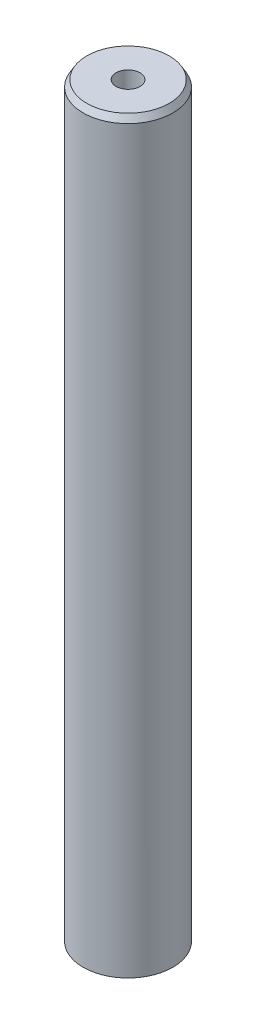
ISO-10303-21;
HEADER;
FILE_DESCRIPTION(('STEP AP214'),'2;1');
FILE_NAME('part.step','',(''),(''),'','','');
FILE_SCHEMA(('AUTOMOTIVE_DESIGN { 1 0 10303 214 1 1 1 1 }'));
ENDSEC;
DATA;
#1=APPLICATION_CONTEXT('core data for automotive mechanical design processes');
#2=APPLICATION_PROTOCOL_DEFINITION('international standard','automotive_design',2000,#1);
#3=PRODUCT_CONTEXT('',#1,'mechanical');
#4=PRODUCT('Part','Part','',(#3));
#5=PRODUCT_RELATED_PRODUCT_CATEGORY('part','',(#4));
#6=PRODUCT_DEFINITION_FORMATION('','',#4);
#7=PRODUCT_DEFINITION_CONTEXT('part definition',#1,'design');
#8=PRODUCT_DEFINITION('design','',#6,#7);
#9=PRODUCT_DEFINITION_SHAPE('','',#8);
#10=(LENGTH_UNIT() NAMED_UNIT(*) SI_UNIT(.MILLI.,.METRE.));
#11=(NAMED_UNIT(*) PLANE_ANGLE_UNIT() SI_UNIT($,.RADIAN.));
#12=(NAMED_UNIT(*) SI_UNIT($,.STERADIAN.) SOLID_ANGLE_UNIT());
#13=UNCERTAINTY_MEASURE_WITH_UNIT(LENGTH_MEASURE(1.E-05),#10,'distance_accuracy_value','');
#14=(GEOMETRIC_REPRESENTATION_CONTEXT(3) GLOBAL_UNCERTAINTY_ASSIGNED_CONTEXT((#13)) GLOBAL_UNIT_ASSIGNED_CONTEXT((#10,
#11,#12)) REPRESENTATION_CONTEXT('',''));
#15=CARTESIAN_POINT('',(0.,0.,0.));
#16=DIRECTION('',(0.,0.,1.));
#17=DIRECTION('',(1.,0.,0.));
#18=AXIS2_PLACEMENT_3D('',#15,#16,#17);
#19=CARTESIAN_POINT('',(0.,167.074365916142,0.));
#20=DIRECTION('',(0.,-1.,0.));
#21=DIRECTION('',(0.,0.,-1.));
#22=AXIS2_PLACEMENT_3D('',#19,#20,#21);
#23=CYLINDRICAL_SURFACE('',#22,10.);
#24=CARTESIAN_POINT('',(0.,165.646580664443,0.));
#25=DIRECTION('',(0.,1.,0.));
#26=DIRECTION('',(0.,0.,1.));
#27=AXIS2_PLACEMENT_3D('',#24,#25,#26);
#28=CIRCLE('',#27,10.);
#29=CARTESIAN_POINT('',(0.,165.646580664443,-10.));
#30=VERTEX_POINT('',#29);
#31=EDGE_CURVE('E50',#30,#30,#28,.F.);
#32=CARTESIAN_POINT('',(0.,0.824332199413469,0.));
#33=DIRECTION('',(0.,1.,0.));
#34=DIRECTION('',(0.,0.,1.));
#35=AXIS2_PLACEMENT_3D('',#32,#33,#34);
#36=CIRCLE('',#35,10.);
#37=CARTESIAN_POINT('',(0.,0.824332199413469,-10.));
#38=VERTEX_POINT('',#37);
#39=EDGE_CURVE('E51',#38,#38,#36,.T.);
#40=CARTESIAN_POINT('',(0.,165.646580664443,-10.));
#41=CARTESIAN_POINT('',(0.,163.929682242933,-10.));
#42=CARTESIAN_POINT('',(0.,162.212783821422,-10.));
#43=CARTESIAN_POINT('',(0.,158.7789869784,-10.));
#44=CARTESIAN_POINT('',(0.,157.06208855689,-10.));
#45=CARTESIAN_POINT('',(0.,153.628291713868,-10.));
#46=CARTESIAN_POINT('',(0.,151.911393292357,-10.));
#47=CARTESIAN_POINT('',(0.,148.477596449336,-10.));
#48=CARTESIAN_POINT('',(0.,146.760698027825,-10.));
#49=CARTESIAN_POINT('',(0.,143.326901184804,-10.));
#50=CARTESIAN_POINT('',(0.,141.610002763293,-10.));
#51=CARTESIAN_POINT('',(0.,138.176205920272,-10.));
#52=CARTESIAN_POINT('',(0.,136.459307498761,-10.));
#53=CARTESIAN_POINT('',(0.,133.025510655739,-10.));
#54=CARTESIAN_POINT('',(0.,131.308612234229,-10.));
#55=CARTESIAN_POINT('',(0.,127.874815391207,-10.));
#56=CARTESIAN_POINT('',(0.,126.157916969697,-10.));
#57=CARTESIAN_POINT('',(0.,122.724120126675,-10.));
#58=CARTESIAN_POINT('',(0.,121.007221705164,-10.));
#59=CARTESIAN_POINT('',(0.,117.573424862143,-10.));
#60=CARTESIAN_POINT('',(0.,115.856526440632,-10.));
#61=CARTESIAN_POINT('',(0.,112.422729597611,-10.));
#62=CARTESIAN_POINT('',(0.,110.7058311761,-10.));
#63=CARTESIAN_POINT('',(0.,107.272034333079,-10.));
#64=CARTESIAN_POINT('',(0.,105.555135911568,-10.));
#65=CARTESIAN_POINT('',(0.,102.121339068546,-10.));
#66=CARTESIAN_POINT('',(0.,100.404440647036,-10.));
#67=CARTESIAN_POINT('',(0.,96.9706438040142,-10.));
#68=CARTESIAN_POINT('',(0.,95.2537453825035,-10.));
#69=CARTESIAN_POINT('',(0.,91.819948539482,-10.));
#70=CARTESIAN_POINT('',(0.,90.1030501179713,-10.));
#71=CARTESIAN_POINT('',(0.,86.6692532749498,-10.));
#72=CARTESIAN_POINT('',(0.,84.9523548534391,-10.));
#73=CARTESIAN_POINT('',(0.,81.5185580104176,-10.));
#74=CARTESIAN_POINT('',(0.,79.8016595889069,-10.));
#75=CARTESIAN_POINT('',(0.,76.3678627458854,-10.));
#76=CARTESIAN_POINT('',(0.,74.6509643243747,-10.));
#77=CARTESIAN_POINT('',(0.,71.2171674813533,-10.));
#78=CARTESIAN_POINT('',(0.,69.5002690598425,-10.));
#79=CARTESIAN_POINT('',(0.,66.0664722168211,-10.));
#80=CARTESIAN_POINT('',(0.,64.3495737953103,-10.));
#81=CARTESIAN_POINT('',(0.,60.9157769522889,-10.));
#82=CARTESIAN_POINT('',(0.,59.1988785307782,-10.));
#83=CARTESIAN_POINT('',(0.,55.7650816877567,-10.));
#84=CARTESIAN_POINT('',(0.,54.048183266246,-10.));
#85=CARTESIAN_POINT('',(0.,50.6143864232245,-10.));
#86=CARTESIAN_POINT('',(0.,48.8974880017138,-10.));
#87=CARTESIAN_POINT('',(0.,45.4636911586924,-10.));
#88=CARTESIAN_POINT('',(0.,43.7467927371816,-10.));
#89=CARTESIAN_POINT('',(0.,40.3129958941602,-10.));
#90=CARTESIAN_POINT('',(0.,38.5960974726494,-10.));
#91=CARTESIAN_POINT('',(0.,35.162300629628,-10.));
#92=CARTESIAN_POINT('',(0.,33.4454022081173,-10.));
#93=CARTESIAN_POINT('',(0.,30.0116053650958,-10.));
#94=CARTESIAN_POINT('',(0.,28.2947069435851,-10.));
#95=CARTESIAN_POINT('',(0.,24.8609101005636,-10.));
#96=CARTESIAN_POINT('',(0.,23.1440116790529,-10.));
#97=CARTESIAN_POINT('',(0.,19.7102148360315,-10.));
#98=CARTESIAN_POINT('',(0.,17.9933164145207,-10.));
#99=CARTESIAN_POINT('',(0.,14.5595195714993,-10.));
#100=CARTESIAN_POINT('',(0.,12.8426211499886,-10.));
#101=CARTESIAN_POINT('',(0.,9.4088243069671,-10.));
#102=CARTESIAN_POINT('',(0.,7.69192588545636,-10.));
#103=CARTESIAN_POINT('',(0.,4.25812904243491,-10.));
#104=CARTESIAN_POINT('',(0.,2.54123062092419,-10.));
#105=CARTESIAN_POINT('',(0.,0.824332199413469,-10.));
#106=B_SPLINE_CURVE_WITH_KNOTS('',3,(#40,#41,#42,#43,#44,#45,#46,#47,#48,#49,#50,#51,#52,#53,
#54,#55,#56,#57,#58,#59,#60,#61,#62,#63,#64,#65,#66,#67,#68,#69,#70,#71,#72,#73,#74,#75,#76,#77,
#78,#79,#80,#81,#82,#83,#84,#85,#86,#87,#88,#89,#90,#91,#92,#93,#94,#95,#96,#97,#98,#99,#100,
#101,#102,#103,#104,#105),.UNSPECIFIED.,.F.,.F.,(4,2,2,2,2,2,2,2,2,2,2,2,2,2,2,2,2,2,2,2,2,2,2,
2,2,2,2,2,2,2,2,2,4),(0.,5.15069526453218,10.3013905290644,15.4520857935966,20.6027810581287,
25.7534763226609,30.9041715871931,36.0548668517253,41.2055621162575,46.3562573807896,
51.5069526453218,56.657647909854,61.8083431743862,66.9590384389184,72.1097337034505,
77.2604289679827,82.4111242325149,87.5618194970471,92.7125147615793,97.8632100261114,
103.013905290644,108.164600555176,113.315295819708,118.46599108424,123.616686348772,
128.767381613305,133.918076877837,139.068772142369,144.219467406901,149.370162671433,
154.520857935965,159.671553200498,164.82224846503),.UNSPECIFIED.);
#107=EDGE_CURVE('BSEAM39',#30,#38,#106,.T.);
#108=ORIENTED_EDGE('',*,*,#31,.T.);
#109=ORIENTED_EDGE('',*,*,#39,.T.);
#110=ORIENTED_EDGE('',*,*,#107,.T.);
#111=ORIENTED_EDGE('',*,*,#107,.F.);
#112=EDGE_LOOP('',(#108,#110,#109,#111));
#113=FACE_BOUND('',#112,.T.);
#114=ADVANCED_FACE('F39',(#113),#23,.T.);
#115=CARTESIAN_POINT('',(0.,167.074365916142,0.));
#116=DIRECTION('',(0.,1.,0.));
#117=DIRECTION('',(0.,0.,1.));
#118=AXIS2_PLACEMENT_3D('',#115,#116,#117);
#119=PLANE('',#118);
#120=CARTESIAN_POINT('',(0.,167.074365916142,0.));
#121=DIRECTION('',(0.,1.,0.));
#122=DIRECTION('',(0.,0.,1.));
#123=AXIS2_PLACEMENT_3D('',#120,#121,#122);
#124=CIRCLE('',#123,9.17566780058651);
#125=CARTESIAN_POINT('',(0.,167.074365916142,-9.17566780058652));
#126=VERTEX_POINT('',#125);
#127=EDGE_CURVE('E54',#126,#126,#124,.T.);
#128=ORIENTED_EDGE('',*,*,#127,.T.);
#129=EDGE_LOOP('',(#128));
#130=FACE_BOUND('',#129,.T.);
#131=CARTESIAN_POINT('',(0.,167.074365916142,0.));
#132=DIRECTION('',(0.,1.,0.));
#133=DIRECTION('',(0.,0.,1.));
#134=AXIS2_PLACEMENT_3D('',#131,#132,#133);
#135=CIRCLE('',#134,2.66048674027892);
#136=CARTESIAN_POINT('',(0.,167.074365916142,2.66048674027892));
#137=VERTEX_POINT('',#136);
#138=EDGE_CURVE('E58',#137,#137,#135,.T.);
#139=ORIENTED_EDGE('',*,*,#138,.F.);
#140=EDGE_LOOP('',(#139));
#141=FACE_BOUND('',#140,.T.);
#142=ADVANCED_FACE('F69',(#130,#141),#119,.T.);
#143=CARTESIAN_POINT('',(0.,0.,0.));
#144=DIRECTION('',(0.,1.,0.));
#145=DIRECTION('',(0.,0.,1.));
#146=AXIS2_PLACEMENT_3D('',#143,#144,#145);
#147=PLANE('',#146);
#148=CARTESIAN_POINT('',(0.,0.,0.));
#149=DIRECTION('',(0.,1.,0.));
#150=DIRECTION('',(0.,0.,1.));
#151=AXIS2_PLACEMENT_3D('',#148,#149,#150);
#152=CIRCLE('',#151,8.57221474830083);
#153=CARTESIAN_POINT('',(0.,0.,8.57221474830083));
#154=VERTEX_POINT('',#153);
#155=EDGE_CURVE('E10',#154,#154,#152,.F.);
#156=ORIENTED_EDGE('',*,*,#155,.T.);
#157=EDGE_LOOP('',(#156));
#158=FACE_BOUND('',#157,.T.);
#159=CARTESIAN_POINT('',(0.,0.,0.));
#160=DIRECTION('',(0.,1.,0.));
#161=DIRECTION('',(0.,0.,1.));
#162=AXIS2_PLACEMENT_3D('',#159,#160,#161);
#163=CIRCLE('',#162,2.66048674027892);
#164=CARTESIAN_POINT('',(0.,0.,2.66048674027892));
#165=VERTEX_POINT('',#164);
#166=EDGE_CURVE('E63',#165,#165,#163,.T.);
#167=ORIENTED_EDGE('',*,*,#166,.T.);
#168=EDGE_LOOP('',(#167));
#169=FACE_BOUND('',#168,.T.);
#170=ADVANCED_FACE('F75',(#158,#169),#147,.F.);
#171=CARTESIAN_POINT('',(0.,167.074365916142,0.));
#172=DIRECTION('',(0.,-1.,0.));
#173=DIRECTION('',(0.,0.,-1.));
#174=AXIS2_PLACEMENT_3D('',#171,#172,#173);
#175=CYLINDRICAL_SURFACE('',#174,2.66048674027892);
#176=ORIENTED_EDGE('',*,*,#138,.T.);
#177=EDGE_LOOP('',(#176));
#178=FACE_BOUND('',#177,.T.);
#179=ORIENTED_EDGE('',*,*,#166,.F.);
#180=EDGE_LOOP('',(#179));
#181=FACE_BOUND('',#180,.T.);
#182=ADVANCED_FACE('F70',(#178,#181),#175,.F.);
#183=CARTESIAN_POINT('',(0.,167.074365916142,0.));
#184=DIRECTION('',(0.,-1.,0.));
#185=DIRECTION('',(0.,0.,-1.));
#186=AXIS2_PLACEMENT_3D('',#183,#184,#185);
#187=CONICAL_SURFACE('',#186,9.17566780058651,0.523598775598294);
#188=CARTESIAN_POINT('',(0.,165.646580664443,-10.));
#189=CARTESIAN_POINT('',(0.,165.661453427482,-9.99141320625612));
#190=CARTESIAN_POINT('',(0.,165.67632619052,-9.98282641251223));
#191=CARTESIAN_POINT('',(0.,165.706071716597,-9.96565282502445));
#192=CARTESIAN_POINT('',(0.,165.720944479636,-9.95706603128055));
#193=CARTESIAN_POINT('',(0.,165.750690005713,-9.93989244379277));
#194=CARTESIAN_POINT('',(0.,165.765562768752,-9.93130565004889));
#195=CARTESIAN_POINT('',(0.,165.795308294829,-9.91413206256111));
#196=CARTESIAN_POINT('',(0.,165.810181057867,-9.90554526881721));
#197=CARTESIAN_POINT('',(0.,165.839926583944,-9.88837168132943));
#198=CARTESIAN_POINT('',(0.,165.854799346983,-9.87978488758554));
#199=CARTESIAN_POINT('',(0.,165.88454487306,-9.86261130009776));
#200=CARTESIAN_POINT('',(0.,165.899417636098,-9.85402450635387));
#201=CARTESIAN_POINT('',(0.,165.929163162175,-9.83685091886609));
#202=CARTESIAN_POINT('',(0.,165.944035925214,-9.8282641251222));
#203=CARTESIAN_POINT('',(0.,165.973781451291,-9.81109053763442));
#204=CARTESIAN_POINT('',(0.,165.98865421433,-9.80250374389052));
#205=CARTESIAN_POINT('',(0.,166.018399740407,-9.78533015640275));
#206=CARTESIAN_POINT('',(0.,166.033272503445,-9.77674336265886));
#207=CARTESIAN_POINT('',(0.,166.063018029522,-9.75956977517108));
#208=CARTESIAN_POINT('',(0.,166.077890792561,-9.75098298142718));
#209=CARTESIAN_POINT('',(0.,166.107636318638,-9.7338093939394));
#210=CARTESIAN_POINT('',(0.,166.122509081676,-9.72522260019551));
#211=CARTESIAN_POINT('',(0.,166.152254607753,-9.70804901270773));
#212=CARTESIAN_POINT('',(0.,166.167127370792,-9.69946221896384));
#213=CARTESIAN_POINT('',(0.,166.196872896869,-9.68228863147606));
#214=CARTESIAN_POINT('',(0.,166.211745659908,-9.67370183773217));
#215=CARTESIAN_POINT('',(0.,166.241491185985,-9.65652825024439));
#216=CARTESIAN_POINT('',(0.,166.256363949023,-9.6479414565005));
#217=CARTESIAN_POINT('',(0.,166.2861094751,-9.63076786901272));
#218=CARTESIAN_POINT('',(0.,166.300982238139,-9.62218107526883));
#219=CARTESIAN_POINT('',(0.,166.330727764216,-9.60500748778104));
#220=CARTESIAN_POINT('',(0.,166.345600527254,-9.59642069403715));
#221=CARTESIAN_POINT('',(0.,166.375346053331,-9.57924710654937));
#222=CARTESIAN_POINT('',(0.,166.39021881637,-9.57066031280549));
#223=CARTESIAN_POINT('',(0.,166.419964342447,-9.55348672531771));
#224=CARTESIAN_POINT('',(0.,166.434837105486,-9.54489993157381));
#225=CARTESIAN_POINT('',(0.,166.464582631563,-9.52772634408603));
#226=CARTESIAN_POINT('',(0.,166.479455394601,-9.51913955034214));
#227=CARTESIAN_POINT('',(0.,166.509200920678,-9.50196596285436));
#228=CARTESIAN_POINT('',(0.,166.524073683717,-9.49337916911047));
#229=CARTESIAN_POINT('',(0.,166.553819209794,-9.47620558162269));
#230=CARTESIAN_POINT('',(0.,166.568691972832,-9.46761878787879));
#231=CARTESIAN_POINT('',(0.,166.598437498909,-9.45044520039101));
#232=CARTESIAN_POINT('',(0.,166.613310261948,-9.44185840664713));
#233=CARTESIAN_POINT('',(0.,166.643055788025,-9.42468481915935));
#234=CARTESIAN_POINT('',(0.,166.657928551064,-9.41609802541545));
#235=CARTESIAN_POINT('',(0.,166.687674077141,-9.39892443792767));
#236=CARTESIAN_POINT('',(0.,166.702546840179,-9.39033764418378));
#237=CARTESIAN_POINT('',(0.,166.732292366256,-9.373164056696));
#238=CARTESIAN_POINT('',(0.,166.747165129295,-9.36457726295211));
#239=CARTESIAN_POINT('',(0.,166.776910655372,-9.34740367546433));
#240=CARTESIAN_POINT('',(0.,166.79178341841,-9.33881688172044));
#241=CARTESIAN_POINT('',(0.,166.821528944487,-9.32164329423266));
#242=CARTESIAN_POINT('',(0.,166.836401707526,-9.31305650048877));
#243=CARTESIAN_POINT('',(0.,166.866147233603,-9.29588291300099));
#244=CARTESIAN_POINT('',(0.,166.881019996641,-9.2872961192571));
#245=CARTESIAN_POINT('',(0.,166.910765522719,-9.27012253176932));
#246=CARTESIAN_POINT('',(0.,166.925638285757,-9.26153573802542));
#247=CARTESIAN_POINT('',(0.,166.955383811834,-9.24436215053764));
#248=CARTESIAN_POINT('',(0.,166.970256574873,-9.23577535679376));
#249=CARTESIAN_POINT('',(0.,167.00000210095,-9.21860176930597));
#250=CARTESIAN_POINT('',(0.,167.014874863988,-9.21001497556208));
#251=CARTESIAN_POINT('',(0.,167.044620390065,-9.1928413880743));
#252=CARTESIAN_POINT('',(0.,167.059493153104,-9.1842545943304));
#253=CARTESIAN_POINT('',(0.,167.074365916142,-9.17566780058652));
#254=B_SPLINE_CURVE_WITH_KNOTS('',3,(#188,#189,#190,#191,#192,#193,#194,#195,#196,#197,#198,
#199,#200,#201,#202,#203,#204,#205,#206,#207,#208,#209,#210,#211,#212,#213,#214,#215,#216,#217,
#218,#219,#220,#221,#222,#223,#224,#225,#226,#227,#228,#229,#230,#231,#232,#233,#234,#235,#236,
#237,#238,#239,#240,#241,#242,#243,#244,#245,#246,#247,#248,#249,#250,#251,#252,#253),
.UNSPECIFIED.,.F.,.F.,(4,2,2,2,2,2,2,2,2,2,2,2,2,2,2,2,2,2,2,2,2,2,2,2,2,2,2,2,2,2,2,2,4),(0.,
0.051520762463359,0.103041524926693,0.154562287390051,0.206083049853386,0.25760381231672,
0.309124574780078,0.360645337243413,0.412166099706748,0.463686862170106,0.515207624633441,
0.566728387096799,0.618249149560133,0.669769912023468,0.721290674486826,0.77281143695016,
0.824332199413495,0.875852961876853,0.927373724340187,0.978894486803546,1.03041524926688,
1.08193601173022,1.13345677419357,1.18497753665691,1.23649829912027,1.2880190615836,
1.33953982404693,1.39106058651029,1.44258134897363,1.49410211143696,1.54562287390032,
1.59714363636366,1.64866439882701),.UNSPECIFIED.);
#255=EDGE_CURVE('BSEAM81',#30,#126,#254,.T.);
#256=ORIENTED_EDGE('',*,*,#31,.F.);
#257=ORIENTED_EDGE('',*,*,#127,.F.);
#258=ORIENTED_EDGE('',*,*,#255,.T.);
#259=ORIENTED_EDGE('',*,*,#255,.F.);
#260=EDGE_LOOP('',(#256,#258,#257,#259));
#261=FACE_BOUND('',#260,.T.);
#262=ADVANCED_FACE('F81',(#261),#187,.T.);
#263=CARTESIAN_POINT('',(0.,0.824332199413469,0.));
#264=DIRECTION('',(0.,1.,0.));
#265=DIRECTION('',(0.,0.,1.));
#266=AXIS2_PLACEMENT_3D('',#263,#264,#265);
#267=CONICAL_SURFACE('',#266,10.,1.04719755119661);
#268=ORIENTED_EDGE('',*,*,#155,.F.);
#269=EDGE_LOOP('',(#268));
#270=FACE_BOUND('',#269,.T.);
#271=ORIENTED_EDGE('',*,*,#39,.F.);
#272=EDGE_LOOP('',(#271));
#273=FACE_BOUND('',#272,.T.);
#274=ADVANCED_FACE('F45',(#270,#273),#267,.T.);
#275=CLOSED_SHELL('',(#114,#142,#170,#182,#262,#274));
#276=MANIFOLD_SOLID_BREP('B2',#275);
#277=ADVANCED_BREP_SHAPE_REPRESENTATION('',(#18,#276),#14);
#278=SHAPE_DEFINITION_REPRESENTATION(#9,#277);
ENDSEC;
END-ISO-10303-21;
